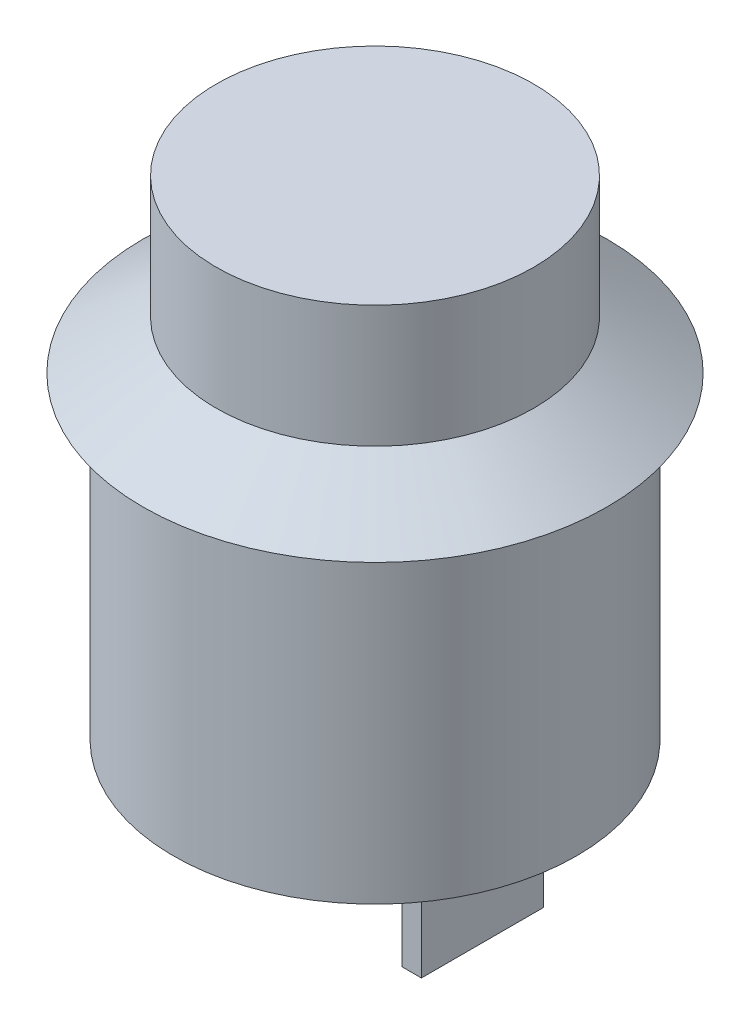
ISO-10303-21;
HEADER;
FILE_DESCRIPTION(('STEP AP214'),'2;1');
FILE_NAME('part.step','',(''),(''),'','','');
FILE_SCHEMA(('AUTOMOTIVE_DESIGN { 1 0 10303 214 1 1 1 1 }'));
ENDSEC;
DATA;
#1=APPLICATION_CONTEXT('core data for automotive mechanical design processes');
#2=APPLICATION_PROTOCOL_DEFINITION('international standard','automotive_design',2000,#1);
#3=PRODUCT_CONTEXT('',#1,'mechanical');
#4=PRODUCT('Part','Part','',(#3));
#5=PRODUCT_RELATED_PRODUCT_CATEGORY('part','',(#4));
#6=PRODUCT_DEFINITION_FORMATION('','',#4);
#7=PRODUCT_DEFINITION_CONTEXT('part definition',#1,'design');
#8=PRODUCT_DEFINITION('design','',#6,#7);
#9=PRODUCT_DEFINITION_SHAPE('','',#8);
#10=(LENGTH_UNIT() NAMED_UNIT(*) SI_UNIT(.MILLI.,.METRE.));
#11=(NAMED_UNIT(*) PLANE_ANGLE_UNIT() SI_UNIT($,.RADIAN.));
#12=(NAMED_UNIT(*) SI_UNIT($,.STERADIAN.) SOLID_ANGLE_UNIT());
#13=UNCERTAINTY_MEASURE_WITH_UNIT(LENGTH_MEASURE(1.E-05),#10,'distance_accuracy_value','');
#14=(GEOMETRIC_REPRESENTATION_CONTEXT(3) GLOBAL_UNCERTAINTY_ASSIGNED_CONTEXT((#13)) GLOBAL_UNIT_ASSIGNED_CONTEXT((#10,
#11,#12)) REPRESENTATION_CONTEXT('',''));
#15=CARTESIAN_POINT('',(0.,0.,0.));
#16=DIRECTION('',(0.,0.,1.));
#17=DIRECTION('',(1.,0.,0.));
#18=AXIS2_PLACEMENT_3D('',#15,#16,#17);
#19=CARTESIAN_POINT('',(0.,0.,0.));
#20=DIRECTION('',(0.,-1.,0.));
#21=DIRECTION('',(1.,0.,0.));
#22=AXIS2_PLACEMENT_3D('',#19,#20,#21);
#23=PLANE('',#22);
#24=CARTESIAN_POINT('',(0.,0.,0.));
#25=DIRECTION('',(0.,-1.,0.));
#26=DIRECTION('',(1.,0.,0.));
#27=AXIS2_PLACEMENT_3D('',#24,#25,#26);
#28=CIRCLE('',#27,8.25);
#29=CARTESIAN_POINT('',(8.25,0.,0.));
#30=VERTEX_POINT('',#29);
#31=EDGE_CURVE('E11',#30,#30,#28,.T.);
#32=ORIENTED_EDGE('',*,*,#31,.T.);
#33=EDGE_LOOP('',(#32));
#34=FACE_BOUND('',#33,.T.);
#35=DIRECTION('',(-1.,0.,0.));
#36=VECTOR('',#35,1.);
#37=CARTESIAN_POINT('',(-4.4,0.,2.5));
#38=LINE('',#37,#36);
#39=CARTESIAN_POINT('',(-3.60000000000001,0.,2.5));
#40=VERTEX_POINT('',#39);
#41=CARTESIAN_POINT('',(-4.4,0.,2.5));
#42=VERTEX_POINT('',#41);
#43=EDGE_CURVE('E127',#40,#42,#38,.T.);
#44=ORIENTED_EDGE('',*,*,#43,.F.);
#45=DIRECTION('',(0.,0.,1.));
#46=VECTOR('',#45,1.);
#47=CARTESIAN_POINT('',(-3.60000000000001,0.,2.5));
#48=LINE('',#47,#46);
#49=CARTESIAN_POINT('',(-3.59999999999999,0.,-2.5));
#50=VERTEX_POINT('',#49);
#51=EDGE_CURVE('E124',#50,#40,#48,.T.);
#52=ORIENTED_EDGE('',*,*,#51,.F.);
#53=DIRECTION('',(1.,0.,0.));
#54=VECTOR('',#53,1.);
#55=CARTESIAN_POINT('',(-4.4,0.,-2.5));
#56=LINE('',#55,#54);
#57=CARTESIAN_POINT('',(-4.4,0.,-2.5));
#58=VERTEX_POINT('',#57);
#59=EDGE_CURVE('E136',#58,#50,#56,.T.);
#60=ORIENTED_EDGE('',*,*,#59,.F.);
#61=DIRECTION('',(0.,0.,-1.));
#62=VECTOR('',#61,1.);
#63=CARTESIAN_POINT('',(-4.4,0.,2.5));
#64=LINE('',#63,#62);
#65=EDGE_CURVE('E144',#42,#58,#64,.T.);
#66=ORIENTED_EDGE('',*,*,#65,.F.);
#67=EDGE_LOOP('',(#44,#52,#60,#66));
#68=FACE_BOUND('',#67,.T.);
#69=DIRECTION('',(-1.,0.,0.));
#70=VECTOR('',#69,1.);
#71=CARTESIAN_POINT('',(3.59999999999999,0.,2.5));
#72=LINE('',#71,#70);
#73=CARTESIAN_POINT('',(4.4,0.,2.5));
#74=VERTEX_POINT('',#73);
#75=CARTESIAN_POINT('',(3.59999999999999,0.,2.5));
#76=VERTEX_POINT('',#75);
#77=EDGE_CURVE('E192',#74,#76,#72,.T.);
#78=ORIENTED_EDGE('',*,*,#77,.F.);
#79=DIRECTION('',(0.,0.,1.));
#80=VECTOR('',#79,1.);
#81=CARTESIAN_POINT('',(4.4,0.,2.5));
#82=LINE('',#81,#80);
#83=CARTESIAN_POINT('',(4.4,0.,-2.5));
#84=VERTEX_POINT('',#83);
#85=EDGE_CURVE('E122',#84,#74,#82,.T.);
#86=ORIENTED_EDGE('',*,*,#85,.F.);
#87=DIRECTION('',(1.,0.,0.));
#88=VECTOR('',#87,1.);
#89=CARTESIAN_POINT('',(3.60000000000001,0.,-2.5));
#90=LINE('',#89,#88);
#91=CARTESIAN_POINT('',(3.60000000000001,0.,-2.5));
#92=VERTEX_POINT('',#91);
#93=EDGE_CURVE('E118',#92,#84,#90,.T.);
#94=ORIENTED_EDGE('',*,*,#93,.F.);
#95=DIRECTION('',(0.,0.,-1.));
#96=VECTOR('',#95,1.);
#97=CARTESIAN_POINT('',(3.59999999999999,0.,2.5));
#98=LINE('',#97,#96);
#99=EDGE_CURVE('E194',#76,#92,#98,.T.);
#100=ORIENTED_EDGE('',*,*,#99,.F.);
#101=EDGE_LOOP('',(#78,#86,#94,#100));
#102=FACE_BOUND('',#101,.T.);
#103=ADVANCED_FACE('F34',(#34,#68,#102),#23,.T.);
#104=CARTESIAN_POINT('',(9.57567358739198E-13,-275.009579946917,0.));
#105=DIRECTION('',(0.,-1.,0.));
#106=DIRECTION('',(1.,0.,0.));
#107=AXIS2_PLACEMENT_3D('',#104,#105,#106);
#108=CYLINDRICAL_SURFACE('',#107,8.25000000000002);
#109=CARTESIAN_POINT('',(0.,13.,0.));
#110=DIRECTION('',(0.,-1.,0.));
#111=DIRECTION('',(1.,0.,0.));
#112=AXIS2_PLACEMENT_3D('',#109,#110,#111);
#113=CIRCLE('',#112,8.25000000000005);
#114=CARTESIAN_POINT('',(8.25,13.,0.));
#115=VERTEX_POINT('',#114);
#116=EDGE_CURVE('E41',#115,#115,#113,.T.);
#117=ORIENTED_EDGE('',*,*,#116,.T.);
#118=EDGE_LOOP('',(#117));
#119=FACE_BOUND('',#118,.T.);
#120=ORIENTED_EDGE('',*,*,#31,.F.);
#121=EDGE_LOOP('',(#120));
#122=FACE_BOUND('',#121,.T.);
#123=ADVANCED_FACE('F166',(#119,#122),#108,.T.);
#124=CARTESIAN_POINT('',(8.24999999999999,13.,0.));
#125=DIRECTION('',(0.,-1.,0.));
#126=DIRECTION('',(1.,0.,0.));
#127=AXIS2_PLACEMENT_3D('',#124,#125,#126);
#128=PLANE('',#127);
#129=CARTESIAN_POINT('',(0.,13.,0.));
#130=DIRECTION('',(0.,-1.,0.));
#131=DIRECTION('',(1.,0.,0.));
#132=AXIS2_PLACEMENT_3D('',#129,#130,#131);
#133=CIRCLE('',#132,9.50000000000004);
#134=CARTESIAN_POINT('',(9.5,13.,0.));
#135=VERTEX_POINT('',#134);
#136=EDGE_CURVE('E161',#135,#135,#133,.T.);
#137=ORIENTED_EDGE('',*,*,#136,.T.);
#138=EDGE_LOOP('',(#137));
#139=FACE_BOUND('',#138,.T.);
#140=ORIENTED_EDGE('',*,*,#116,.F.);
#141=EDGE_LOOP('',(#140));
#142=FACE_BOUND('',#141,.T.);
#143=ADVANCED_FACE('F169',(#139,#142),#128,.T.);
#144=CARTESIAN_POINT('',(0.,13.,0.));
#145=DIRECTION('',(0.,-1.,0.));
#146=DIRECTION('',(1.,0.,0.));
#147=AXIS2_PLACEMENT_3D('',#144,#145,#146);
#148=CONICAL_SURFACE('',#147,9.50000000000004,0.982793723247462);
#149=CARTESIAN_POINT('',(0.,15.,0.));
#150=DIRECTION('',(0.,-1.,0.));
#151=DIRECTION('',(1.,0.,0.));
#152=AXIS2_PLACEMENT_3D('',#149,#150,#151);
#153=CIRCLE('',#152,6.49999999999909);
#154=CARTESIAN_POINT('',(6.49999999999904,15.,0.));
#155=VERTEX_POINT('',#154);
#156=EDGE_CURVE('E158',#155,#155,#153,.T.);
#157=ORIENTED_EDGE('',*,*,#156,.T.);
#158=EDGE_LOOP('',(#157));
#159=FACE_BOUND('',#158,.T.);
#160=ORIENTED_EDGE('',*,*,#136,.F.);
#161=EDGE_LOOP('',(#160));
#162=FACE_BOUND('',#161,.T.);
#163=ADVANCED_FACE('F171',(#159,#162),#148,.T.);
#164=CARTESIAN_POINT('',(9.57567358739198E-13,-275.009579946917,0.));
#165=DIRECTION('',(0.,-1.,0.));
#166=DIRECTION('',(1.,0.,0.));
#167=AXIS2_PLACEMENT_3D('',#164,#165,#166);
#168=CYLINDRICAL_SURFACE('',#167,6.4999999999991);
#169=CARTESIAN_POINT('',(0.,20.,0.));
#170=DIRECTION('',(0.,-1.,0.));
#171=DIRECTION('',(1.,0.,0.));
#172=AXIS2_PLACEMENT_3D('',#169,#170,#171);
#173=CIRCLE('',#172,6.49999999999911);
#174=CARTESIAN_POINT('',(6.49999999999904,20.,0.));
#175=VERTEX_POINT('',#174);
#176=EDGE_CURVE('E155',#175,#175,#173,.T.);
#177=ORIENTED_EDGE('',*,*,#176,.T.);
#178=EDGE_LOOP('',(#177));
#179=FACE_BOUND('',#178,.T.);
#180=ORIENTED_EDGE('',*,*,#156,.F.);
#181=EDGE_LOOP('',(#180));
#182=FACE_BOUND('',#181,.T.);
#183=ADVANCED_FACE('F178',(#179,#182),#168,.T.);
#184=CARTESIAN_POINT('',(6.49999999999903,20.,0.));
#185=DIRECTION('',(0.,1.,0.));
#186=DIRECTION('',(-1.,0.,0.));
#187=AXIS2_PLACEMENT_3D('',#184,#185,#186);
#188=PLANE('',#187);
#189=ORIENTED_EDGE('',*,*,#176,.F.);
#190=EDGE_LOOP('',(#189));
#191=FACE_BOUND('',#190,.T.);
#192=ADVANCED_FACE('F237',(#191),#188,.T.);
#193=CARTESIAN_POINT('',(-3.59999999999998,-5.00000000000001,2.5));
#194=DIRECTION('',(-1.,0.,0.));
#195=DIRECTION('',(0.,-1.,0.));
#196=AXIS2_PLACEMENT_3D('',#193,#194,#195);
#197=PLANE('',#196);
#198=ORIENTED_EDGE('',*,*,#51,.T.);
#199=DIRECTION('',(0.,1.,0.));
#200=VECTOR('',#199,1.);
#201=CARTESIAN_POINT('',(-3.59999999999998,-5.00000000000001,2.5));
#202=LINE('',#201,#200);
#203=CARTESIAN_POINT('',(-3.59999999999998,-5.00000000000001,2.5));
#204=VERTEX_POINT('',#203);
#205=EDGE_CURVE('E153',#204,#40,#202,.T.);
#206=ORIENTED_EDGE('',*,*,#205,.F.);
#207=DIRECTION('',(0.,0.,1.));
#208=VECTOR('',#207,1.);
#209=CARTESIAN_POINT('',(-3.59999999999998,-5.00000000000001,2.5));
#210=LINE('',#209,#208);
#211=CARTESIAN_POINT('',(-3.59999999999998,-5.00000000000001,-2.5));
#212=VERTEX_POINT('',#211);
#213=EDGE_CURVE('E132',#212,#204,#210,.T.);
#214=ORIENTED_EDGE('',*,*,#213,.F.);
#215=DIRECTION('',(0.,1.,0.));
#216=VECTOR('',#215,1.);
#217=CARTESIAN_POINT('',(-3.59999999999998,-5.00000000000001,-2.5));
#218=LINE('',#217,#216);
#219=EDGE_CURVE('E141',#212,#50,#218,.T.);
#220=ORIENTED_EDGE('',*,*,#219,.T.);
#221=EDGE_LOOP('',(#198,#206,#214,#220));
#222=FACE_BOUND('',#221,.T.);
#223=ADVANCED_FACE('F233',(#222),#197,.F.);
#224=CARTESIAN_POINT('',(-4.39999999999999,-5.00000000000001,2.5));
#225=DIRECTION('',(0.,0.,-1.));
#226=DIRECTION('',(-1.,0.,0.));
#227=AXIS2_PLACEMENT_3D('',#224,#225,#226);
#228=PLANE('',#227);
#229=ORIENTED_EDGE('',*,*,#43,.T.);
#230=DIRECTION('',(0.,1.,0.));
#231=VECTOR('',#230,1.);
#232=CARTESIAN_POINT('',(-4.39999999999999,-5.00000000000001,2.5));
#233=LINE('',#232,#231);
#234=CARTESIAN_POINT('',(-4.39999999999999,-5.00000000000001,2.5));
#235=VERTEX_POINT('',#234);
#236=EDGE_CURVE('E150',#235,#42,#233,.T.);
#237=ORIENTED_EDGE('',*,*,#236,.F.);
#238=DIRECTION('',(-1.,0.,0.));
#239=VECTOR('',#238,1.);
#240=CARTESIAN_POINT('',(-4.39999999999999,-5.00000000000001,2.5));
#241=LINE('',#240,#239);
#242=EDGE_CURVE('E135',#204,#235,#241,.T.);
#243=ORIENTED_EDGE('',*,*,#242,.F.);
#244=ORIENTED_EDGE('',*,*,#205,.T.);
#245=EDGE_LOOP('',(#229,#237,#243,#244));
#246=FACE_BOUND('',#245,.T.);
#247=ADVANCED_FACE('F229',(#246),#228,.F.);
#248=CARTESIAN_POINT('',(-4.39999999999999,-5.00000000000001,2.5));
#249=DIRECTION('',(1.,0.,0.));
#250=DIRECTION('',(0.,1.,0.));
#251=AXIS2_PLACEMENT_3D('',#248,#249,#250);
#252=PLANE('',#251);
#253=ORIENTED_EDGE('',*,*,#65,.T.);
#254=DIRECTION('',(0.,1.,0.));
#255=VECTOR('',#254,1.);
#256=CARTESIAN_POINT('',(-4.39999999999999,-5.00000000000001,-2.5));
#257=LINE('',#256,#255);
#258=CARTESIAN_POINT('',(-4.39999999999999,-5.00000000000001,-2.5));
#259=VERTEX_POINT('',#258);
#260=EDGE_CURVE('E56',#259,#58,#257,.T.);
#261=ORIENTED_EDGE('',*,*,#260,.F.);
#262=DIRECTION('',(0.,0.,-1.));
#263=VECTOR('',#262,1.);
#264=CARTESIAN_POINT('',(-4.39999999999999,-5.00000000000001,2.5));
#265=LINE('',#264,#263);
#266=EDGE_CURVE('E138',#235,#259,#265,.T.);
#267=ORIENTED_EDGE('',*,*,#266,.F.);
#268=ORIENTED_EDGE('',*,*,#236,.T.);
#269=EDGE_LOOP('',(#253,#261,#267,#268));
#270=FACE_BOUND('',#269,.T.);
#271=ADVANCED_FACE('F226',(#270),#252,.F.);
#272=CARTESIAN_POINT('',(-4.39999999999999,-5.00000000000001,-2.5));
#273=DIRECTION('',(0.,0.,1.));
#274=DIRECTION('',(1.,0.,0.));
#275=AXIS2_PLACEMENT_3D('',#272,#273,#274);
#276=PLANE('',#275);
#277=ORIENTED_EDGE('',*,*,#59,.T.);
#278=ORIENTED_EDGE('',*,*,#219,.F.);
#279=DIRECTION('',(1.,0.,0.));
#280=VECTOR('',#279,1.);
#281=CARTESIAN_POINT('',(-4.39999999999999,-5.00000000000001,-2.5));
#282=LINE('',#281,#280);
#283=EDGE_CURVE('E140',#259,#212,#282,.T.);
#284=ORIENTED_EDGE('',*,*,#283,.F.);
#285=ORIENTED_EDGE('',*,*,#260,.T.);
#286=EDGE_LOOP('',(#277,#278,#284,#285));
#287=FACE_BOUND('',#286,.T.);
#288=ADVANCED_FACE('F222',(#287),#276,.F.);
#289=CARTESIAN_POINT('',(0.,-5.,0.));
#290=DIRECTION('',(0.,-1.,0.));
#291=DIRECTION('',(1.,0.,0.));
#292=AXIS2_PLACEMENT_3D('',#289,#290,#291);
#293=PLANE('',#292);
#294=ORIENTED_EDGE('',*,*,#213,.T.);
#295=ORIENTED_EDGE('',*,*,#242,.T.);
#296=ORIENTED_EDGE('',*,*,#266,.T.);
#297=ORIENTED_EDGE('',*,*,#283,.T.);
#298=EDGE_LOOP('',(#294,#295,#296,#297));
#299=FACE_BOUND('',#298,.T.);
#300=ADVANCED_FACE('F219',(#299),#293,.T.);
#301=CARTESIAN_POINT('',(4.40000000000001,-4.99999999999999,2.5));
#302=DIRECTION('',(-1.,0.,0.));
#303=DIRECTION('',(0.,-1.,0.));
#304=AXIS2_PLACEMENT_3D('',#301,#302,#303);
#305=PLANE('',#304);
#306=ORIENTED_EDGE('',*,*,#85,.T.);
#307=DIRECTION('',(0.,1.,0.));
#308=VECTOR('',#307,1.);
#309=CARTESIAN_POINT('',(4.40000000000001,-4.99999999999999,2.5));
#310=LINE('',#309,#308);
#311=CARTESIAN_POINT('',(4.40000000000001,-4.99999999999999,2.5));
#312=VERTEX_POINT('',#311);
#313=EDGE_CURVE('E103',#312,#74,#310,.T.);
#314=ORIENTED_EDGE('',*,*,#313,.F.);
#315=DIRECTION('',(0.,0.,1.));
#316=VECTOR('',#315,1.);
#317=CARTESIAN_POINT('',(4.40000000000001,-4.99999999999999,2.5));
#318=LINE('',#317,#316);
#319=CARTESIAN_POINT('',(4.40000000000001,-4.99999999999999,-2.5));
#320=VERTEX_POINT('',#319);
#321=EDGE_CURVE('E110',#320,#312,#318,.T.);
#322=ORIENTED_EDGE('',*,*,#321,.F.);
#323=DIRECTION('',(0.,1.,0.));
#324=VECTOR('',#323,1.);
#325=CARTESIAN_POINT('',(4.40000000000001,-4.99999999999999,-2.5));
#326=LINE('',#325,#324);
#327=EDGE_CURVE('E201',#320,#84,#326,.T.);
#328=ORIENTED_EDGE('',*,*,#327,.T.);
#329=EDGE_LOOP('',(#306,#314,#322,#328));
#330=FACE_BOUND('',#329,.T.);
#331=ADVANCED_FACE('F120',(#330),#305,.F.);
#332=CARTESIAN_POINT('',(3.60000000000002,-4.99999999999999,2.5));
#333=DIRECTION('',(0.,0.,-1.));
#334=DIRECTION('',(-1.,0.,0.));
#335=AXIS2_PLACEMENT_3D('',#332,#333,#334);
#336=PLANE('',#335);
#337=ORIENTED_EDGE('',*,*,#77,.T.);
#338=DIRECTION('',(0.,1.,0.));
#339=VECTOR('',#338,1.);
#340=CARTESIAN_POINT('',(3.60000000000002,-4.99999999999999,2.5));
#341=LINE('',#340,#339);
#342=CARTESIAN_POINT('',(3.60000000000002,-4.99999999999999,2.5));
#343=VERTEX_POINT('',#342);
#344=EDGE_CURVE('E106',#343,#76,#341,.T.);
#345=ORIENTED_EDGE('',*,*,#344,.F.);
#346=DIRECTION('',(-1.,0.,0.));
#347=VECTOR('',#346,1.);
#348=CARTESIAN_POINT('',(3.60000000000002,-4.99999999999999,2.5));
#349=LINE('',#348,#347);
#350=EDGE_CURVE('E99',#312,#343,#349,.T.);
#351=ORIENTED_EDGE('',*,*,#350,.F.);
#352=ORIENTED_EDGE('',*,*,#313,.T.);
#353=EDGE_LOOP('',(#337,#345,#351,#352));
#354=FACE_BOUND('',#353,.T.);
#355=ADVANCED_FACE('F101',(#354),#336,.F.);
#356=CARTESIAN_POINT('',(3.60000000000002,-4.99999999999999,2.5));
#357=DIRECTION('',(1.,0.,0.));
#358=DIRECTION('',(0.,1.,0.));
#359=AXIS2_PLACEMENT_3D('',#356,#357,#358);
#360=PLANE('',#359);
#361=ORIENTED_EDGE('',*,*,#99,.T.);
#362=DIRECTION('',(0.,1.,0.));
#363=VECTOR('',#362,1.);
#364=CARTESIAN_POINT('',(3.60000000000002,-4.99999999999999,-2.5));
#365=LINE('',#364,#363);
#366=CARTESIAN_POINT('',(3.60000000000002,-4.99999999999999,-2.5));
#367=VERTEX_POINT('',#366);
#368=EDGE_CURVE('E48',#367,#92,#365,.T.);
#369=ORIENTED_EDGE('',*,*,#368,.F.);
#370=DIRECTION('',(0.,0.,-1.));
#371=VECTOR('',#370,1.);
#372=CARTESIAN_POINT('',(3.60000000000002,-4.99999999999999,2.5));
#373=LINE('',#372,#371);
#374=EDGE_CURVE('E109',#343,#367,#373,.T.);
#375=ORIENTED_EDGE('',*,*,#374,.F.);
#376=ORIENTED_EDGE('',*,*,#344,.T.);
#377=EDGE_LOOP('',(#361,#369,#375,#376));
#378=FACE_BOUND('',#377,.T.);
#379=ADVANCED_FACE('F204',(#378),#360,.F.);
#380=CARTESIAN_POINT('',(3.60000000000002,-4.99999999999999,-2.5));
#381=DIRECTION('',(0.,0.,1.));
#382=DIRECTION('',(1.,0.,0.));
#383=AXIS2_PLACEMENT_3D('',#380,#381,#382);
#384=PLANE('',#383);
#385=ORIENTED_EDGE('',*,*,#93,.T.);
#386=ORIENTED_EDGE('',*,*,#327,.F.);
#387=DIRECTION('',(1.,0.,0.));
#388=VECTOR('',#387,1.);
#389=CARTESIAN_POINT('',(3.60000000000002,-4.99999999999999,-2.5));
#390=LINE('',#389,#388);
#391=EDGE_CURVE('E114',#367,#320,#390,.T.);
#392=ORIENTED_EDGE('',*,*,#391,.F.);
#393=ORIENTED_EDGE('',*,*,#368,.T.);
#394=EDGE_LOOP('',(#385,#386,#392,#393));
#395=FACE_BOUND('',#394,.T.);
#396=ADVANCED_FACE('F205',(#395),#384,.F.);
#397=CARTESIAN_POINT('',(0.,-5.,0.));
#398=DIRECTION('',(0.,-1.,0.));
#399=DIRECTION('',(1.,0.,0.));
#400=AXIS2_PLACEMENT_3D('',#397,#398,#399);
#401=PLANE('',#400);
#402=ORIENTED_EDGE('',*,*,#321,.T.);
#403=ORIENTED_EDGE('',*,*,#350,.T.);
#404=ORIENTED_EDGE('',*,*,#374,.T.);
#405=ORIENTED_EDGE('',*,*,#391,.T.);
#406=EDGE_LOOP('',(#402,#403,#404,#405));
#407=FACE_BOUND('',#406,.T.);
#408=ADVANCED_FACE('F113',(#407),#401,.T.);
#409=CLOSED_SHELL('',(#103,#123,#143,#163,#183,#192,#223,#247,#271,#288,#300,#331,#355,#379,
#396,#408));
#410=MANIFOLD_SOLID_BREP('B2',#409);
#411=ADVANCED_BREP_SHAPE_REPRESENTATION('',(#18,#410),#14);
#412=SHAPE_DEFINITION_REPRESENTATION(#9,#411);
ENDSEC;
END-ISO-10303-21;
